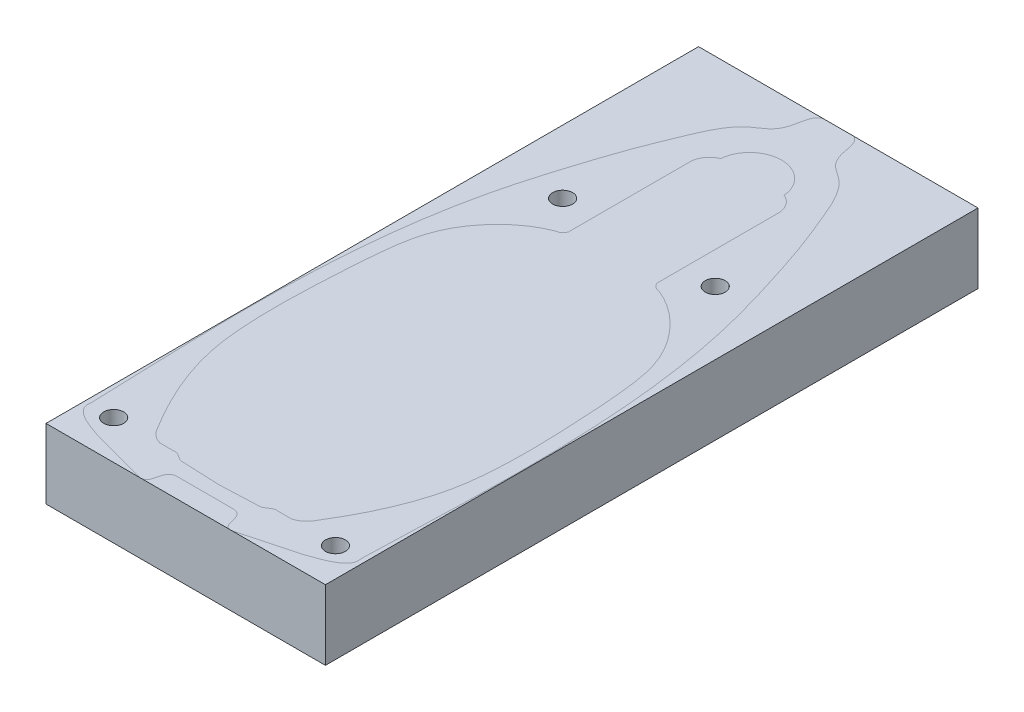
ISO-10303-21;
HEADER;
FILE_DESCRIPTION(('STEP AP214'),'2;1');
FILE_NAME('part.step','',(''),(''),'','','');
FILE_SCHEMA(('AUTOMOTIVE_DESIGN { 1 0 10303 214 1 1 1 1 }'));
ENDSEC;
DATA;
#1=APPLICATION_CONTEXT('core data for automotive mechanical design processes');
#2=APPLICATION_PROTOCOL_DEFINITION('international standard','automotive_design',2000,#1);
#3=PRODUCT_CONTEXT('',#1,'mechanical');
#4=PRODUCT('Part','Part','',(#3));
#5=PRODUCT_RELATED_PRODUCT_CATEGORY('part','',(#4));
#6=PRODUCT_DEFINITION_FORMATION('','',#4);
#7=PRODUCT_DEFINITION_CONTEXT('part definition',#1,'design');
#8=PRODUCT_DEFINITION('design','',#6,#7);
#9=PRODUCT_DEFINITION_SHAPE('','',#8);
#10=(LENGTH_UNIT() NAMED_UNIT(*) SI_UNIT(.MILLI.,.METRE.));
#11=(NAMED_UNIT(*) PLANE_ANGLE_UNIT() SI_UNIT($,.RADIAN.));
#12=(NAMED_UNIT(*) SI_UNIT($,.STERADIAN.) SOLID_ANGLE_UNIT());
#13=UNCERTAINTY_MEASURE_WITH_UNIT(LENGTH_MEASURE(1.E-05),#10,'distance_accuracy_value','');
#14=(GEOMETRIC_REPRESENTATION_CONTEXT(3) GLOBAL_UNCERTAINTY_ASSIGNED_CONTEXT((#13)) GLOBAL_UNIT_ASSIGNED_CONTEXT((#10,
#11,#12)) REPRESENTATION_CONTEXT('',''));
#15=CARTESIAN_POINT('',(0.,0.,0.));
#16=DIRECTION('',(0.,0.,1.));
#17=DIRECTION('',(1.,0.,0.));
#18=AXIS2_PLACEMENT_3D('',#15,#16,#17);
#19=CARTESIAN_POINT('',(0.,0.,0.));
#20=DIRECTION('',(0.,1.,0.));
#21=DIRECTION('',(0.,0.,1.));
#22=AXIS2_PLACEMENT_3D('',#19,#20,#21);
#23=PLANE('',#22);
#24=CARTESIAN_POINT('',(49.0771390945343,0.,5.29231725308454));
#25=CARTESIAN_POINT('',(50.0643876971976,0.,-26.1166546003382));
#26=CARTESIAN_POINT('',(52.5308597652175,0.,-73.6432190761408));
#27=CARTESIAN_POINT('',(44.7383078884643,0.,-128.665983430975));
#28=CARTESIAN_POINT('',(35.9601332946944,0.,-157.773461945844));
#29=CARTESIAN_POINT('',(30.5496339932385,0.,-174.097860196995));
#30=CARTESIAN_POINT('',(25.1053448282694,0.,-187.023597166548));
#31=CARTESIAN_POINT('',(21.9225096731139,0.,-195.198487494332));
#32=CARTESIAN_POINT('',(17.1350520974341,0.,-200.878659028551));
#33=CARTESIAN_POINT('',(13.9883491589994,0.,-202.878315551012));
#34=CARTESIAN_POINT('',(10.4503111705911,0.,-205.542036854755));
#35=CARTESIAN_POINT('',(8.81846815225018,0.,-209.809743179157));
#36=CARTESIAN_POINT('',(8.28664446761546,0.,-214.603179479271));
#37=CARTESIAN_POINT('',(6.56648538168442,0.,-217.643267046185));
#38=CARTESIAN_POINT('',(4.44551305669855,0.,-217.442534032527));
#39=B_SPLINE_CURVE_WITH_KNOTS('',3,(#24,#25,#26,#27,#28,#29,#30,#31,#32,#33,#34,#35,#36,#37,
#38),.UNSPECIFIED.,.F.,.F.,(4,1,1,1,1,1,1,1,1,1,1,1,4),(0.,0.403543259874789,0.608256673125079,
0.708690029533401,0.793482633199347,0.828511750834164,0.889032788817372,0.904436963315368,
0.922735578708441,0.936741401648004,0.960440646033117,0.977903149186417,1.),.UNSPECIFIED.);
#40=CARTESIAN_POINT('',(5.10291944520036,0.,-217.442534032527));
#41=VERTEX_POINT('',#40);
#42=CARTESIAN_POINT('',(49.0771390945343,0.,5.29231725308449));
#43=VERTEX_POINT('',#42);
#44=EDGE_CURVE('E397',#41,#43,#39,.F.);
#45=ORIENTED_EDGE('',*,*,#44,.F.);
#46=DIRECTION('',(1.,0.,0.));
#47=VECTOR('',#46,1.);
#48=CARTESIAN_POINT('',(0.,0.,-217.442534032527));
#49=LINE('',#48,#47);
#50=CARTESIAN_POINT('',(4.44551305669855,0.,-217.442534032527));
#51=VERTEX_POINT('',#50);
#52=EDGE_CURVE('E292',#51,#41,#49,.T.);
#53=ORIENTED_EDGE('',*,*,#52,.F.);
#54=DIRECTION('',(1.,0.,0.));
#55=VECTOR('',#54,1.);
#56=CARTESIAN_POINT('',(0.,0.,-217.442534032527));
#57=LINE('',#56,#55);
#58=CARTESIAN_POINT('',(-5.10291944519914,0.,-217.442534032527));
#59=VERTEX_POINT('',#58);
#60=EDGE_CURVE('E297',#59,#51,#57,.T.);
#61=ORIENTED_EDGE('',*,*,#60,.F.);
#62=CARTESIAN_POINT('',(-4.44551305669855,0.,-217.442534032527));
#63=CARTESIAN_POINT('',(-6.56648538168442,0.,-217.643267046185));
#64=CARTESIAN_POINT('',(-8.28664446761557,0.,-214.603179479271));
#65=CARTESIAN_POINT('',(-8.81846815225012,0.,-209.809743179157));
#66=CARTESIAN_POINT('',(-10.4503111705909,0.,-205.542036854756));
#67=CARTESIAN_POINT('',(-13.9883491589995,0.,-202.878315551012));
#68=CARTESIAN_POINT('',(-17.135052097434,0.,-200.878659028551));
#69=CARTESIAN_POINT('',(-21.922509673114,0.,-195.198487494332));
#70=CARTESIAN_POINT('',(-25.1053448282694,0.,-187.023597166548));
#71=CARTESIAN_POINT('',(-30.5496339932385,0.,-174.097860196995));
#72=CARTESIAN_POINT('',(-35.9601332946944,0.,-157.773461945844));
#73=CARTESIAN_POINT('',(-44.7383078884644,0.,-128.665983430975));
#74=CARTESIAN_POINT('',(-52.5308597652175,0.,-73.6432190761409));
#75=CARTESIAN_POINT('',(-50.0643876971976,0.,-26.1166546003381));
#76=CARTESIAN_POINT('',(-49.0771390945343,0.,5.29231725308466));
#77=B_SPLINE_CURVE_WITH_KNOTS('',3,(#62,#63,#64,#65,#66,#67,#68,#69,#70,#71,#72,#73,#74,#75,
#76),.UNSPECIFIED.,.F.,.F.,(4,1,1,1,1,1,1,1,1,1,1,1,4),(0.,0.0220968508135826,
0.0395593539668829,0.0632585983519958,0.0772644212915593,0.0955630366846325,0.110967211182628,
0.171488249165836,0.206517366800653,0.291309970466599,0.391743326874921,0.596456740125211,1.),.UNSPECIFIED.);
#78=CARTESIAN_POINT('',(-49.0771390945343,0.,5.2923172530846));
#79=VERTEX_POINT('',#78);
#80=EDGE_CURVE('E381',#79,#59,#77,.F.);
#81=ORIENTED_EDGE('',*,*,#80,.F.);
#82=CARTESIAN_POINT('',(-49.0771390945343,0.,5.2923172530846));
#83=CARTESIAN_POINT('',(-50.5688883170867,0.,10.9400693856976));
#84=CARTESIAN_POINT('',(-38.8328719776198,0.,13.504300857401));
#85=CARTESIAN_POINT('',(-37.419094930345,0.,14.3418901157242));
#86=B_SPLINE_CURVE_WITH_KNOTS('',3,(#82,#83,#84,#85),.UNSPECIFIED.,.F.,.F.,(4,4),(0.,1.),.UNSPECIFIED.);
#87=CARTESIAN_POINT('',(-37.419094930345,0.,14.3418901157242));
#88=VERTEX_POINT('',#87);
#89=EDGE_CURVE('E375',#88,#79,#86,.F.);
#90=ORIENTED_EDGE('',*,*,#89,.F.);
#91=DIRECTION('',(-0.966268306599688,0.,-0.257537491757941));
#92=VECTOR('',#91,1.);
#93=CARTESIAN_POINT('',(-6.05082630126968,0.,22.702409826807));
#94=LINE('',#93,#92);
#95=CARTESIAN_POINT('',(-18.3852400543082,0.,19.4149440592082));
#96=VERTEX_POINT('',#95);
#97=EDGE_CURVE('E371',#96,#88,#94,.T.);
#98=ORIENTED_EDGE('',*,*,#97,.F.);
#99=CARTESIAN_POINT('',(-18.3852400543082,0.,19.4149440592082));
#100=CARTESIAN_POINT('',(-11.6134098720276,0.,21.8048769182164));
#101=CARTESIAN_POINT('',(-15.7198055855271,0.,13.4117589348677));
#102=CARTESIAN_POINT('',(-10.5714203288874,0.,12.7273836483514));
#103=B_SPLINE_CURVE_WITH_KNOTS('',3,(#99,#100,#101,#102),.UNSPECIFIED.,.F.,.F.,(4,4),(0.,1.),.UNSPECIFIED.);
#104=CARTESIAN_POINT('',(-16.3294710793143,0.,19.8418554112533));
#105=VERTEX_POINT('',#104);
#106=EDGE_CURVE('E365',#105,#96,#103,.F.);
#107=ORIENTED_EDGE('',*,*,#106,.F.);
#108=CARTESIAN_POINT('',(-10.5714203288874,0.,12.7273836483514));
#109=VERTEX_POINT('',#108);
#110=EDGE_CURVE('E358',#109,#105,#103,.F.);
#111=ORIENTED_EDGE('',*,*,#110,.F.);
#112=DIRECTION('',(-1.,0.,0.));
#113=VECTOR('',#112,1.);
#114=CARTESIAN_POINT('',(0.,0.,12.7273836483513));
#115=LINE('',#114,#113);
#116=CARTESIAN_POINT('',(10.5714203288874,0.,12.7273836483514));
#117=VERTEX_POINT('',#116);
#118=EDGE_CURVE('E351',#117,#109,#115,.T.);
#119=ORIENTED_EDGE('',*,*,#118,.F.);
#120=CARTESIAN_POINT('',(10.5714203288874,0.,12.7273836483514));
#121=CARTESIAN_POINT('',(15.7198055855273,0.,13.4117589348679));
#122=CARTESIAN_POINT('',(11.6134098720275,0.,21.804876918216));
#123=CARTESIAN_POINT('',(18.3852400543081,0.,19.4149440592081));
#124=B_SPLINE_CURVE_WITH_KNOTS('',3,(#120,#121,#122,#123),.UNSPECIFIED.,.F.,.F.,(4,4),(0.,1.),.UNSPECIFIED.);
#125=CARTESIAN_POINT('',(16.3294710793472,0.,19.8418554112533));
#126=VERTEX_POINT('',#125);
#127=EDGE_CURVE('E344',#126,#117,#124,.F.);
#128=ORIENTED_EDGE('',*,*,#127,.F.);
#129=CARTESIAN_POINT('',(18.3852400543081,0.,19.4149440592081));
#130=VERTEX_POINT('',#129);
#131=EDGE_CURVE('E350',#130,#126,#124,.F.);
#132=ORIENTED_EDGE('',*,*,#131,.F.);
#133=DIRECTION('',(-0.966268306599688,0.,0.25753749175794));
#134=VECTOR('',#133,1.);
#135=CARTESIAN_POINT('',(6.05082630126964,0.,22.7024098268069));
#136=LINE('',#135,#134);
#137=CARTESIAN_POINT('',(37.419094930345,0.,14.3418901157241));
#138=VERTEX_POINT('',#137);
#139=EDGE_CURVE('E364',#138,#130,#136,.T.);
#140=ORIENTED_EDGE('',*,*,#139,.F.);
#141=CARTESIAN_POINT('',(37.419094930345,0.,14.3418901157241));
#142=CARTESIAN_POINT('',(38.832871977619,0.,13.5043008574007));
#143=CARTESIAN_POINT('',(50.5688883170869,0.,10.9400693856976));
#144=CARTESIAN_POINT('',(49.0771390945343,0.,5.29231725308449));
#145=B_SPLINE_CURVE_WITH_KNOTS('',3,(#141,#142,#143,#144),.UNSPECIFIED.,.F.,.F.,(4,4),(0.,1.),.UNSPECIFIED.);
#146=EDGE_CURVE('E389',#43,#138,#145,.F.);
#147=ORIENTED_EDGE('',*,*,#146,.F.);
#148=EDGE_LOOP('',(#45,#53,#61,#81,#90,#98,#107,#111,#119,#128,#132,#140,#147));
#149=FACE_BOUND('',#148,.T.);
#150=CARTESIAN_POINT('',(40.3206229095368,0.,5.71600751054374));
#151=DIRECTION('',(0.,1.,0.));
#152=DIRECTION('',(0.,0.,1.));
#153=AXIS2_PLACEMENT_3D('',#150,#151,#152);
#154=CIRCLE('',#153,3.6247382617778);
#155=CARTESIAN_POINT('',(40.3206229095368,0.,9.34074577232154));
#156=VERTEX_POINT('',#155);
#157=EDGE_CURVE('E318',#156,#156,#154,.F.);
#158=ORIENTED_EDGE('',*,*,#157,.T.);
#159=EDGE_LOOP('',(#158));
#160=FACE_BOUND('',#159,.T.);
#161=CARTESIAN_POINT('',(-40.3206229095368,0.,5.71600751054385));
#162=DIRECTION('',(0.,1.,0.));
#163=DIRECTION('',(0.,0.,1.));
#164=AXIS2_PLACEMENT_3D('',#161,#162,#163);
#165=CIRCLE('',#164,3.62473826177782);
#166=CARTESIAN_POINT('',(-40.3206229095368,0.,9.34074577232168));
#167=VERTEX_POINT('',#166);
#168=EDGE_CURVE('E322',#167,#167,#165,.T.);
#169=ORIENTED_EDGE('',*,*,#168,.F.);
#170=EDGE_LOOP('',(#169));
#171=FACE_BOUND('',#170,.T.);
#172=CARTESIAN_POINT('',(-27.7449906587386,0.,-144.952451062197));
#173=DIRECTION('',(0.,1.,0.));
#174=DIRECTION('',(0.,0.,1.));
#175=AXIS2_PLACEMENT_3D('',#172,#173,#174);
#176=CIRCLE('',#175,3.62473826177782);
#177=CARTESIAN_POINT('',(-27.7449906587386,0.,-141.327712800419));
#178=VERTEX_POINT('',#177);
#179=EDGE_CURVE('E212',#178,#178,#176,.T.);
#180=ORIENTED_EDGE('',*,*,#179,.F.);
#181=EDGE_LOOP('',(#180));
#182=FACE_BOUND('',#181,.T.);
#183=CARTESIAN_POINT('',(27.7449906587385,0.,-144.952451062197));
#184=DIRECTION('',(0.,1.,0.));
#185=DIRECTION('',(0.,0.,1.));
#186=AXIS2_PLACEMENT_3D('',#183,#184,#185);
#187=CIRCLE('',#186,3.6247382617778);
#188=CARTESIAN_POINT('',(27.7449906587385,0.,-141.327712800419));
#189=VERTEX_POINT('',#188);
#190=EDGE_CURVE('E208',#189,#189,#187,.F.);
#191=ORIENTED_EDGE('',*,*,#190,.T.);
#192=EDGE_LOOP('',(#191));
#193=FACE_BOUND('',#192,.T.);
#194=DIRECTION('',(0.,0.,-1.));
#195=VECTOR('',#194,1.);
#196=CARTESIAN_POINT('',(-16.1045382347162,0.,0.));
#197=LINE('',#196,#195);
#198=CARTESIAN_POINT('',(-16.1045382347163,0.,-135.534945765243));
#199=VERTEX_POINT('',#198);
#200=CARTESIAN_POINT('',(-16.1045382347162,0.,-179.48987237625));
#201=VERTEX_POINT('',#200);
#202=EDGE_CURVE('E54',#199,#201,#197,.T.);
#203=ORIENTED_EDGE('',*,*,#202,.T.);
#204=CARTESIAN_POINT('',(-8.92288832461977,0.,-179.48987237625));
#205=DIRECTION('',(0.,1.,0.));
#206=DIRECTION('',(0.,0.,1.));
#207=AXIS2_PLACEMENT_3D('',#204,#205,#206);
#208=CIRCLE('',#207,7.18164991009649);
#209=CARTESIAN_POINT('',(-11.5472751039841,0.,-186.174832321043));
#210=VERTEX_POINT('',#209);
#211=EDGE_CURVE('E11',#201,#210,#208,.F.);
#212=ORIENTED_EDGE('',*,*,#211,.T.);
#213=CARTESIAN_POINT('',(0.,0.,-185.222255850204));
#214=DIRECTION('',(0.,1.,0.));
#215=DIRECTION('',(0.,0.,1.));
#216=AXIS2_PLACEMENT_3D('',#213,#214,#215);
#217=CIRCLE('',#216,11.5864992236605);
#218=CARTESIAN_POINT('',(11.5472751039841,0.,-186.174832321043));
#219=VERTEX_POINT('',#218);
#220=EDGE_CURVE('E405',#210,#219,#217,.F.);
#221=ORIENTED_EDGE('',*,*,#220,.T.);
#222=CARTESIAN_POINT('',(8.92288832461979,0.,-179.48987237625));
#223=DIRECTION('',(0.,1.,0.));
#224=DIRECTION('',(0.,0.,1.));
#225=AXIS2_PLACEMENT_3D('',#222,#223,#224);
#226=CIRCLE('',#225,7.18164991009647);
#227=CARTESIAN_POINT('',(16.1045382347163,0.,-179.48987237625));
#228=VERTEX_POINT('',#227);
#229=EDGE_CURVE('E412',#219,#228,#226,.F.);
#230=ORIENTED_EDGE('',*,*,#229,.T.);
#231=DIRECTION('',(0.,0.,1.));
#232=VECTOR('',#231,1.);
#233=CARTESIAN_POINT('',(16.1045382347162,0.,0.));
#234=LINE('',#233,#232);
#235=CARTESIAN_POINT('',(16.1045382347162,0.,-135.534945765243));
#236=VERTEX_POINT('',#235);
#237=EDGE_CURVE('E416',#228,#236,#234,.T.);
#238=ORIENTED_EDGE('',*,*,#237,.T.);
#239=CARTESIAN_POINT('',(19.0012718307022,0.,-136.351122874709));
#240=DIRECTION('',(0.,1.,0.));
#241=DIRECTION('',(0.,0.,1.));
#242=AXIS2_PLACEMENT_3D('',#239,#240,#241);
#243=CIRCLE('',#242,3.00951999497092);
#244=CARTESIAN_POINT('',(18.7446615171418,0.,-133.352562929151));
#245=VERTEX_POINT('',#244);
#246=EDGE_CURVE('E420',#236,#245,#243,.T.);
#247=ORIENTED_EDGE('',*,*,#246,.T.);
#248=CARTESIAN_POINT('',(28.9897543021521,0.,1.11262704182102));
#249=CARTESIAN_POINT('',(35.9471156603791,0.,-10.0985478623123));
#250=CARTESIAN_POINT('',(43.216376698589,0.,-25.6573281184342));
#251=CARTESIAN_POINT('',(45.6029115810602,0.,-47.6860224426251));
#252=CARTESIAN_POINT('',(45.8816375135089,0.,-62.8086245314313));
#253=CARTESIAN_POINT('',(45.0500773289797,0.,-79.5297272696832));
#254=CARTESIAN_POINT('',(43.965647760869,0.,-96.1245135547548));
#255=CARTESIAN_POINT('',(41.637553201633,0.,-111.373856913353));
#256=CARTESIAN_POINT('',(32.6029748866559,0.,-124.998790744143));
#257=CARTESIAN_POINT('',(24.0724426524856,0.,-131.292430099998));
#258=CARTESIAN_POINT('',(18.7446615171418,0.,-133.352562929151));
#259=B_SPLINE_CURVE_WITH_KNOTS('',3,(#248,#249,#250,#251,#252,#253,#254,#255,#256,#257,#258),
.UNSPECIFIED.,.F.,.F.,(4,1,1,1,1,1,1,1,4),(0.,0.270443115932794,0.337210977163026,
0.449064606803327,0.577405053328751,0.676752021145974,0.788024920003265,0.885248270529085,1.),.UNSPECIFIED.);
#260=CARTESIAN_POINT('',(28.9897543021521,0.,1.11262704182102));
#261=VERTEX_POINT('',#260);
#262=EDGE_CURVE('E424',#245,#261,#259,.F.);
#263=ORIENTED_EDGE('',*,*,#262,.T.);
#264=CARTESIAN_POINT('',(23.9297097430107,0.,5.29231725308449));
#265=CARTESIAN_POINT('',(26.1031516888282,0.,4.73079484247713));
#266=CARTESIAN_POINT('',(27.9741559493832,0.,3.09986950265528));
#267=CARTESIAN_POINT('',(28.9897543021521,0.,1.11262704182102));
#268=B_SPLINE_CURVE_WITH_KNOTS('',3,(#264,#265,#266,#267),.UNSPECIFIED.,.F.,.F.,(4,4),(0.,1.),.UNSPECIFIED.);
#269=CARTESIAN_POINT('',(23.9297097430107,0.,5.29231725308449));
#270=VERTEX_POINT('',#269);
#271=EDGE_CURVE('E430',#261,#270,#268,.F.);
#272=ORIENTED_EDGE('',*,*,#271,.T.);
#273=DIRECTION('',(-1.,0.,0.));
#274=VECTOR('',#273,1.);
#275=CARTESIAN_POINT('',(0.,0.,5.29231725308449));
#276=LINE('',#275,#274);
#277=CARTESIAN_POINT('',(19.0012718307022,0.,5.29231725308449));
#278=VERTEX_POINT('',#277);
#279=EDGE_CURVE('E439',#270,#278,#276,.T.);
#280=ORIENTED_EDGE('',*,*,#279,.T.);
#281=CARTESIAN_POINT('',(14.3058881807214,0.,7.10813264219567));
#282=CARTESIAN_POINT('',(16.0767091536674,0.,6.85623125618423));
#283=CARTESIAN_POINT('',(16.9934407863588,0.,4.84756479524606));
#284=CARTESIAN_POINT('',(19.0012718307022,0.,5.29231725308449));
#285=B_SPLINE_CURVE_WITH_KNOTS('',3,(#281,#282,#283,#284),.UNSPECIFIED.,.F.,.F.,(4,4),(0.,1.),.UNSPECIFIED.);
#286=CARTESIAN_POINT('',(14.3058881807214,0.,7.10813264219567));
#287=VERTEX_POINT('',#286);
#288=EDGE_CURVE('E446',#278,#287,#285,.F.);
#289=ORIENTED_EDGE('',*,*,#288,.T.);
#290=DIRECTION('',(-0.999106162356931,0.,0.0422714601167913));
#291=VECTOR('',#290,1.);
#292=CARTESIAN_POINT('',(0.32576542618756,0.,7.69962153868293));
#293=LINE('',#292,#291);
#294=CARTESIAN_POINT('',(0.,0.,7.71340443857821));
#295=VERTEX_POINT('',#294);
#296=EDGE_CURVE('E452',#287,#295,#293,.T.);
#297=ORIENTED_EDGE('',*,*,#296,.T.);
#298=DIRECTION('',(-0.999106162356932,0.,-0.0422714601167836));
#299=VECTOR('',#298,1.);
#300=CARTESIAN_POINT('',(-0.3257654261875,0.,7.69962153868294));
#301=LINE('',#300,#299);
#302=CARTESIAN_POINT('',(-14.3058881807214,0.,7.10813264219579));
#303=VERTEX_POINT('',#302);
#304=EDGE_CURVE('E459',#295,#303,#301,.T.);
#305=ORIENTED_EDGE('',*,*,#304,.T.);
#306=CARTESIAN_POINT('',(-19.0012718307022,0.,5.2923172530846));
#307=CARTESIAN_POINT('',(-16.9934407863586,0.,4.84756479524601));
#308=CARTESIAN_POINT('',(-16.0767091536676,0.,6.85623125618451));
#309=CARTESIAN_POINT('',(-14.3058881807214,0.,7.10813264219579));
#310=B_SPLINE_CURVE_WITH_KNOTS('',3,(#306,#307,#308,#309),.UNSPECIFIED.,.F.,.F.,(4,4),(0.,1.),.UNSPECIFIED.);
#311=CARTESIAN_POINT('',(-19.0012718307022,0.,5.2923172530846));
#312=VERTEX_POINT('',#311);
#313=EDGE_CURVE('E463',#303,#312,#310,.F.);
#314=ORIENTED_EDGE('',*,*,#313,.T.);
#315=DIRECTION('',(-1.,0.,0.));
#316=VECTOR('',#315,1.);
#317=CARTESIAN_POINT('',(0.,0.,5.2923172530846));
#318=LINE('',#317,#316);
#319=CARTESIAN_POINT('',(-23.9297097430108,0.,5.2923172530846));
#320=VERTEX_POINT('',#319);
#321=EDGE_CURVE('E469',#312,#320,#318,.T.);
#322=ORIENTED_EDGE('',*,*,#321,.T.);
#323=CARTESIAN_POINT('',(-28.9897543021521,0.,1.11262704182113));
#324=CARTESIAN_POINT('',(-27.9741559493833,0.,3.09986950265539));
#325=CARTESIAN_POINT('',(-26.1031516888281,0.,4.73079484247724));
#326=CARTESIAN_POINT('',(-23.9297097430108,0.,5.2923172530846));
#327=B_SPLINE_CURVE_WITH_KNOTS('',3,(#323,#324,#325,#326),.UNSPECIFIED.,.F.,.F.,(4,4),(0.,1.),.UNSPECIFIED.);
#328=CARTESIAN_POINT('',(-28.9897543021521,0.,1.11262704182113));
#329=VERTEX_POINT('',#328);
#330=EDGE_CURVE('E476',#320,#329,#327,.F.);
#331=ORIENTED_EDGE('',*,*,#330,.T.);
#332=CARTESIAN_POINT('',(-18.7446615171418,0.,-133.352562929151));
#333=CARTESIAN_POINT('',(-24.0724426524855,0.,-131.292430099998));
#334=CARTESIAN_POINT('',(-32.602974886656,0.,-124.998790744143));
#335=CARTESIAN_POINT('',(-41.637553201633,0.,-111.373856913353));
#336=CARTESIAN_POINT('',(-43.965647760869,0.,-96.1245135547549));
#337=CARTESIAN_POINT('',(-45.0500773289798,0.,-79.5297272696831));
#338=CARTESIAN_POINT('',(-45.8816375135087,0.,-62.8086245314311));
#339=CARTESIAN_POINT('',(-45.6029115810603,0.,-47.686022442625));
#340=CARTESIAN_POINT('',(-43.2163766985889,0.,-25.657328118434));
#341=CARTESIAN_POINT('',(-35.9471156603794,0.,-10.0985478623124));
#342=CARTESIAN_POINT('',(-28.9897543021521,0.,1.11262704182108));
#343=B_SPLINE_CURVE_WITH_KNOTS('',3,(#332,#333,#334,#335,#336,#337,#338,#339,#340,#341,#342),
.UNSPECIFIED.,.F.,.F.,(4,1,1,1,1,1,1,1,4),(0.,0.114751729470915,0.211975079996735,
0.323247978854026,0.422594946671248,0.550935393196673,0.662789022836974,0.729556884067206,1.),.UNSPECIFIED.);
#344=CARTESIAN_POINT('',(-18.7446615171418,0.,-133.352562929151));
#345=VERTEX_POINT('',#344);
#346=EDGE_CURVE('E482',#329,#345,#343,.F.);
#347=ORIENTED_EDGE('',*,*,#346,.T.);
#348=CARTESIAN_POINT('',(-19.0012718307022,0.,-136.351122874709));
#349=DIRECTION('',(0.,1.,0.));
#350=DIRECTION('',(0.,0.,1.));
#351=AXIS2_PLACEMENT_3D('',#348,#349,#350);
#352=CIRCLE('',#351,3.00951999497094);
#353=EDGE_CURVE('E491',#345,#199,#352,.T.);
#354=ORIENTED_EDGE('',*,*,#353,.T.);
#355=EDGE_LOOP('',(#203,#212,#221,#230,#238,#247,#263,#272,#280,#289,#297,#305,#314,#322,#331,
#347,#354));
#356=FACE_BOUND('',#355,.T.);
#357=ADVANCED_FACE('F45',(#149,#160,#171,#182,#193,#356),#23,.T.);
#358=DIRECTION('',(1.,0.,0.));
#359=VECTOR('',#358,1.);
#360=CARTESIAN_POINT('',(0.,0.,-217.442534032527));
#361=LINE('',#360,#359);
#362=CARTESIAN_POINT('',(50.8,0.,-217.442534032527));
#363=VERTEX_POINT('',#362);
#364=EDGE_CURVE('E298',#41,#363,#361,.T.);
#365=ORIENTED_EDGE('',*,*,#364,.F.);
#366=ORIENTED_EDGE('',*,*,#44,.T.);
#367=ORIENTED_EDGE('',*,*,#146,.T.);
#368=ORIENTED_EDGE('',*,*,#139,.T.);
#369=ORIENTED_EDGE('',*,*,#131,.T.);
#370=DIRECTION('',(1.,0.,0.));
#371=VECTOR('',#370,1.);
#372=CARTESIAN_POINT('',(0.,0.,19.8418554112533));
#373=LINE('',#372,#371);
#374=CARTESIAN_POINT('',(50.8,0.,19.8418554112533));
#375=VERTEX_POINT('',#374);
#376=EDGE_CURVE('E610',#126,#375,#373,.T.);
#377=ORIENTED_EDGE('',*,*,#376,.T.);
#378=DIRECTION('',(0.,0.,1.));
#379=VECTOR('',#378,1.);
#380=CARTESIAN_POINT('',(50.8,0.,0.));
#381=LINE('',#380,#379);
#382=EDGE_CURVE('E198',#363,#375,#381,.T.);
#383=ORIENTED_EDGE('',*,*,#382,.F.);
#384=EDGE_LOOP('',(#365,#366,#367,#368,#369,#377,#383));
#385=FACE_BOUND('',#384,.T.);
#386=ADVANCED_FACE('F256',(#385),#23,.T.);
#387=ORIENTED_EDGE('',*,*,#89,.T.);
#388=ORIENTED_EDGE('',*,*,#80,.T.);
#389=CARTESIAN_POINT('',(-50.8,0.,-217.442534032527));
#390=VERTEX_POINT('',#389);
#391=EDGE_CURVE('E302',#390,#59,#57,.T.);
#392=ORIENTED_EDGE('',*,*,#391,.F.);
#393=DIRECTION('',(0.,0.,1.));
#394=VECTOR('',#393,1.);
#395=CARTESIAN_POINT('',(-50.8,0.,0.));
#396=LINE('',#395,#394);
#397=CARTESIAN_POINT('',(-50.8,0.,19.8418554112533));
#398=VERTEX_POINT('',#397);
#399=EDGE_CURVE('E314',#390,#398,#396,.T.);
#400=ORIENTED_EDGE('',*,*,#399,.T.);
#401=EDGE_CURVE('E612',#398,#105,#373,.T.);
#402=ORIENTED_EDGE('',*,*,#401,.T.);
#403=ORIENTED_EDGE('',*,*,#106,.T.);
#404=ORIENTED_EDGE('',*,*,#97,.T.);
#405=EDGE_LOOP('',(#387,#388,#392,#400,#402,#403,#404));
#406=FACE_BOUND('',#405,.T.);
#407=ADVANCED_FACE('F263',(#406),#23,.T.);
#408=ORIENTED_EDGE('',*,*,#118,.T.);
#409=ORIENTED_EDGE('',*,*,#110,.T.);
#410=EDGE_CURVE('E615',#105,#126,#373,.T.);
#411=ORIENTED_EDGE('',*,*,#410,.T.);
#412=ORIENTED_EDGE('',*,*,#127,.T.);
#413=EDGE_LOOP('',(#408,#409,#411,#412));
#414=FACE_BOUND('',#413,.T.);
#415=ADVANCED_FACE('F279',(#414),#23,.T.);
#416=CARTESIAN_POINT('',(4.44551305669855,0.,-217.442534032527));
#417=CARTESIAN_POINT('',(6.56648538168442,0.,-217.643267046185));
#418=CARTESIAN_POINT('',(8.28664446761546,0.,-214.603179479271));
#419=CARTESIAN_POINT('',(8.81846815225018,0.,-209.809743179157));
#420=CARTESIAN_POINT('',(10.4503111705911,0.,-205.542036854755));
#421=CARTESIAN_POINT('',(13.9883491589994,0.,-202.878315551012));
#422=CARTESIAN_POINT('',(17.1350520974341,0.,-200.878659028551));
#423=CARTESIAN_POINT('',(21.9225096731139,0.,-195.198487494332));
#424=CARTESIAN_POINT('',(25.1053448282694,0.,-187.023597166548));
#425=CARTESIAN_POINT('',(30.5496339932385,0.,-174.097860196995));
#426=CARTESIAN_POINT('',(35.9601332946944,0.,-157.773461945844));
#427=CARTESIAN_POINT('',(44.7383078884643,0.,-128.665983430975));
#428=CARTESIAN_POINT('',(52.5308597652175,0.,-73.6432190761408));
#429=CARTESIAN_POINT('',(50.0643876971976,0.,-26.1166546003382));
#430=CARTESIAN_POINT('',(49.0771390945343,0.,5.29231725308454));
#431=B_SPLINE_CURVE_WITH_KNOTS('',3,(#416,#417,#418,#419,#420,#421,#422,#423,#424,#425,#426,
#427,#428,#429,#430),.UNSPECIFIED.,.F.,.F.,(4,1,1,1,1,1,1,1,1,1,1,1,4),(0.,0.0220968508135825,
0.0395593539668829,0.0632585983519959,0.0772644212915592,0.0955630366846324,0.110967211182628,
0.171488249165836,0.206517366800653,0.291309970466599,0.391743326874921,0.596456740125211,1.),.UNSPECIFIED.);
#432=EDGE_CURVE('E290',#51,#41,#431,.T.);
#433=ORIENTED_EDGE('',*,*,#432,.F.);
#434=ORIENTED_EDGE('',*,*,#52,.T.);
#435=EDGE_LOOP('',(#433,#434));
#436=FACE_BOUND('',#435,.T.);
#437=ADVANCED_FACE('F269',(#436),#23,.T.);
#438=CARTESIAN_POINT('',(0.,-25.4,19.8418554112533));
#439=DIRECTION('',(0.,0.,1.));
#440=DIRECTION('',(1.,0.,0.));
#441=AXIS2_PLACEMENT_3D('',#438,#439,#440);
#442=PLANE('',#441);
#443=ORIENTED_EDGE('',*,*,#401,.F.);
#444=DIRECTION('',(0.,1.,0.));
#445=VECTOR('',#444,1.);
#446=CARTESIAN_POINT('',(-50.8,-25.4,19.8418554112533));
#447=LINE('',#446,#445);
#448=CARTESIAN_POINT('',(-50.8,-25.4,19.8418554112533));
#449=VERTEX_POINT('',#448);
#450=EDGE_CURVE('E206',#449,#398,#447,.T.);
#451=ORIENTED_EDGE('',*,*,#450,.F.);
#452=DIRECTION('',(1.,0.,0.));
#453=VECTOR('',#452,1.);
#454=CARTESIAN_POINT('',(0.,-25.4,19.8418554112533));
#455=LINE('',#454,#453);
#456=CARTESIAN_POINT('',(50.8,-25.4,19.8418554112533));
#457=VERTEX_POINT('',#456);
#458=EDGE_CURVE('E184',#449,#457,#455,.T.);
#459=ORIENTED_EDGE('',*,*,#458,.T.);
#460=DIRECTION('',(0.,1.,0.));
#461=VECTOR('',#460,1.);
#462=CARTESIAN_POINT('',(50.8,-25.4,19.8418554112533));
#463=LINE('',#462,#461);
#464=EDGE_CURVE('E195',#457,#375,#463,.T.);
#465=ORIENTED_EDGE('',*,*,#464,.T.);
#466=ORIENTED_EDGE('',*,*,#376,.F.);
#467=ORIENTED_EDGE('',*,*,#410,.F.);
#468=EDGE_LOOP('',(#443,#451,#459,#465,#466,#467));
#469=FACE_BOUND('',#468,.T.);
#470=ADVANCED_FACE('F47',(#469),#442,.T.);
#471=CARTESIAN_POINT('',(-50.8,-25.4,0.));
#472=DIRECTION('',(-1.,0.,0.));
#473=DIRECTION('',(0.,0.,1.));
#474=AXIS2_PLACEMENT_3D('',#471,#472,#473);
#475=PLANE('',#474);
#476=ORIENTED_EDGE('',*,*,#399,.F.);
#477=DIRECTION('',(0.,1.,0.));
#478=VECTOR('',#477,1.);
#479=CARTESIAN_POINT('',(-50.8,-25.4,-217.442534032527));
#480=LINE('',#479,#478);
#481=CARTESIAN_POINT('',(-50.8,-25.4,-217.442534032527));
#482=VERTEX_POINT('',#481);
#483=EDGE_CURVE('E331',#482,#390,#480,.T.);
#484=ORIENTED_EDGE('',*,*,#483,.F.);
#485=DIRECTION('',(0.,0.,1.));
#486=VECTOR('',#485,1.);
#487=CARTESIAN_POINT('',(-50.8,-25.4,0.));
#488=LINE('',#487,#486);
#489=EDGE_CURVE('E601',#482,#449,#488,.T.);
#490=ORIENTED_EDGE('',*,*,#489,.T.);
#491=ORIENTED_EDGE('',*,*,#450,.T.);
#492=EDGE_LOOP('',(#476,#484,#490,#491));
#493=FACE_BOUND('',#492,.T.);
#494=ADVANCED_FACE('F285',(#493),#475,.T.);
#495=CARTESIAN_POINT('',(0.,-25.4,-217.442534032527));
#496=DIRECTION('',(0.,0.,1.));
#497=DIRECTION('',(1.,0.,0.));
#498=AXIS2_PLACEMENT_3D('',#495,#496,#497);
#499=PLANE('',#498);
#500=ORIENTED_EDGE('',*,*,#391,.T.);
#501=ORIENTED_EDGE('',*,*,#60,.T.);
#502=DIRECTION('',(0.,1.,0.));
#503=VECTOR('',#502,1.);
#504=CARTESIAN_POINT('',(4.44551305669855,-25.4,-217.442534032527));
#505=LINE('',#504,#503);
#506=CARTESIAN_POINT('',(4.44551305669855,-25.4,-217.442534032527));
#507=VERTEX_POINT('',#506);
#508=EDGE_CURVE('E334',#507,#51,#505,.T.);
#509=ORIENTED_EDGE('',*,*,#508,.F.);
#510=DIRECTION('',(1.,0.,0.));
#511=VECTOR('',#510,1.);
#512=CARTESIAN_POINT('',(0.,-25.4,-217.442534032527));
#513=LINE('',#512,#511);
#514=EDGE_CURVE('E226',#482,#507,#513,.T.);
#515=ORIENTED_EDGE('',*,*,#514,.F.);
#516=ORIENTED_EDGE('',*,*,#483,.T.);
#517=EDGE_LOOP('',(#500,#501,#509,#515,#516));
#518=FACE_BOUND('',#517,.T.);
#519=ADVANCED_FACE('F237',(#518),#499,.F.);
#520=CARTESIAN_POINT('',(4.44551305669855,-25.4,-217.442534032527));
#521=CARTESIAN_POINT('',(6.56648538168442,-25.4,-217.643267046185));
#522=CARTESIAN_POINT('',(8.28664446761546,-25.4,-214.603179479271));
#523=CARTESIAN_POINT('',(8.81846815225018,-25.4,-209.809743179157));
#524=CARTESIAN_POINT('',(10.4503111705911,-25.4,-205.542036854755));
#525=CARTESIAN_POINT('',(13.9883491589994,-25.4,-202.878315551012));
#526=CARTESIAN_POINT('',(17.1350520974341,-25.4,-200.878659028551));
#527=CARTESIAN_POINT('',(21.9225096731139,-25.4,-195.198487494332));
#528=CARTESIAN_POINT('',(25.1053448282694,-25.4,-187.023597166548));
#529=CARTESIAN_POINT('',(30.5496339932385,-25.4,-174.097860196995));
#530=CARTESIAN_POINT('',(35.9601332946944,-25.4,-157.773461945844));
#531=CARTESIAN_POINT('',(44.7383078884643,-25.4,-128.665983430975));
#532=CARTESIAN_POINT('',(52.5308597652175,-25.4,-73.6432190761408));
#533=CARTESIAN_POINT('',(50.0643876971976,-25.4,-26.1166546003382));
#534=CARTESIAN_POINT('',(49.0771390945343,-25.4,5.29231725308454));
#535=B_SPLINE_CURVE_WITH_KNOTS('',3,(#520,#521,#522,#523,#524,#525,#526,#527,#528,#529,#530,
#531,#532,#533,#534),.UNSPECIFIED.,.F.,.F.,(4,1,1,1,1,1,1,1,1,1,1,1,4),(0.,0.0220968508135825,
0.0395593539668829,0.0632585983519959,0.0772644212915592,0.0955630366846324,0.110967211182628,
0.171488249165836,0.206517366800653,0.291309970466599,0.391743326874921,0.596456740125211,1.),.UNSPECIFIED.);
#536=DIRECTION('',(0.,1.,0.));
#537=VECTOR('',#536,1.);
#538=SURFACE_OF_LINEAR_EXTRUSION('',#535,#537);
#539=ORIENTED_EDGE('',*,*,#432,.T.);
#540=DIRECTION('',(0.,1.,0.));
#541=VECTOR('',#540,1.);
#542=CARTESIAN_POINT('',(5.10291944520036,-25.4,-217.442534032527));
#543=LINE('',#542,#541);
#544=CARTESIAN_POINT('',(5.10291944520036,-25.4,-217.442534032527));
#545=VERTEX_POINT('',#544);
#546=EDGE_CURVE('E337',#545,#41,#543,.T.);
#547=ORIENTED_EDGE('',*,*,#546,.F.);
#548=EDGE_CURVE('E220',#507,#545,#535,.T.);
#549=ORIENTED_EDGE('',*,*,#548,.F.);
#550=ORIENTED_EDGE('',*,*,#508,.T.);
#551=EDGE_LOOP('',(#539,#547,#549,#550));
#552=FACE_BOUND('',#551,.T.);
#553=ADVANCED_FACE('F232',(#552),#538,.F.);
#554=CARTESIAN_POINT('',(0.,-25.4,-217.442534032527));
#555=DIRECTION('',(0.,0.,1.));
#556=DIRECTION('',(1.,0.,0.));
#557=AXIS2_PLACEMENT_3D('',#554,#555,#556);
#558=PLANE('',#557);
#559=ORIENTED_EDGE('',*,*,#364,.T.);
#560=DIRECTION('',(0.,1.,0.));
#561=VECTOR('',#560,1.);
#562=CARTESIAN_POINT('',(50.8,-25.4,-217.442534032527));
#563=LINE('',#562,#561);
#564=CARTESIAN_POINT('',(50.8,-25.4,-217.442534032527));
#565=VERTEX_POINT('',#564);
#566=EDGE_CURVE('E202',#565,#363,#563,.T.);
#567=ORIENTED_EDGE('',*,*,#566,.F.);
#568=DIRECTION('',(1.,0.,0.));
#569=VECTOR('',#568,1.);
#570=CARTESIAN_POINT('',(0.,-25.4,-217.442534032527));
#571=LINE('',#570,#569);
#572=EDGE_CURVE('E187',#545,#565,#571,.T.);
#573=ORIENTED_EDGE('',*,*,#572,.F.);
#574=ORIENTED_EDGE('',*,*,#546,.T.);
#575=EDGE_LOOP('',(#559,#567,#573,#574));
#576=FACE_BOUND('',#575,.T.);
#577=ADVANCED_FACE('F236',(#576),#558,.F.);
#578=CARTESIAN_POINT('',(-27.7449906587386,-25.4,-144.952451062197));
#579=DIRECTION('',(0.,1.,0.));
#580=DIRECTION('',(0.,0.,1.));
#581=AXIS2_PLACEMENT_3D('',#578,#579,#580);
#582=CYLINDRICAL_SURFACE('',#581,3.62473826177782);
#583=CARTESIAN_POINT('',(-27.7449906587386,-25.4,-144.952451062197));
#584=DIRECTION('',(0.,1.,0.));
#585=DIRECTION('',(0.,0.,1.));
#586=AXIS2_PLACEMENT_3D('',#583,#584,#585);
#587=CIRCLE('',#586,3.62473826177782);
#588=CARTESIAN_POINT('',(-27.7449906587386,-25.4,-141.327712800419));
#589=VERTEX_POINT('',#588);
#590=EDGE_CURVE('E589',#589,#589,#587,.T.);
#591=ORIENTED_EDGE('',*,*,#590,.F.);
#592=EDGE_LOOP('',(#591));
#593=FACE_BOUND('',#592,.T.);
#594=ORIENTED_EDGE('',*,*,#179,.T.);
#595=EDGE_LOOP('',(#594));
#596=FACE_BOUND('',#595,.T.);
#597=ADVANCED_FACE('F241',(#593,#596),#582,.F.);
#598=CARTESIAN_POINT('',(-40.3206229095368,-25.4,5.71600751054385));
#599=DIRECTION('',(0.,1.,0.));
#600=DIRECTION('',(0.,0.,1.));
#601=AXIS2_PLACEMENT_3D('',#598,#599,#600);
#602=CYLINDRICAL_SURFACE('',#601,3.62473826177782);
#603=CARTESIAN_POINT('',(-40.3206229095368,-25.4,5.71600751054385));
#604=DIRECTION('',(0.,1.,0.));
#605=DIRECTION('',(0.,0.,1.));
#606=AXIS2_PLACEMENT_3D('',#603,#604,#605);
#607=CIRCLE('',#606,3.62473826177782);
#608=CARTESIAN_POINT('',(-40.3206229095368,-25.4,9.34074577232168));
#609=VERTEX_POINT('',#608);
#610=EDGE_CURVE('E593',#609,#609,#607,.T.);
#611=ORIENTED_EDGE('',*,*,#610,.F.);
#612=EDGE_LOOP('',(#611));
#613=FACE_BOUND('',#612,.T.);
#614=ORIENTED_EDGE('',*,*,#168,.T.);
#615=EDGE_LOOP('',(#614));
#616=FACE_BOUND('',#615,.T.);
#617=ADVANCED_FACE('F252',(#613,#616),#602,.F.);
#618=CARTESIAN_POINT('',(40.3206229095368,-25.4,5.71600751054374));
#619=DIRECTION('',(0.,1.,0.));
#620=DIRECTION('',(0.,0.,1.));
#621=AXIS2_PLACEMENT_3D('',#618,#619,#620);
#622=CYLINDRICAL_SURFACE('',#621,3.6247382617778);
#623=CARTESIAN_POINT('',(40.3206229095368,-25.4,5.71600751054374));
#624=DIRECTION('',(0.,1.,0.));
#625=DIRECTION('',(0.,0.,1.));
#626=AXIS2_PLACEMENT_3D('',#623,#624,#625);
#627=CIRCLE('',#626,3.6247382617778);
#628=CARTESIAN_POINT('',(40.3206229095368,-25.4,9.34074577232154));
#629=VERTEX_POINT('',#628);
#630=EDGE_CURVE('E597',#629,#629,#627,.F.);
#631=ORIENTED_EDGE('',*,*,#630,.T.);
#632=EDGE_LOOP('',(#631));
#633=FACE_BOUND('',#632,.T.);
#634=ORIENTED_EDGE('',*,*,#157,.F.);
#635=EDGE_LOOP('',(#634));
#636=FACE_BOUND('',#635,.T.);
#637=ADVANCED_FACE('F245',(#633,#636),#622,.F.);
#638=CARTESIAN_POINT('',(50.8,-25.4,0.));
#639=DIRECTION('',(-1.,0.,0.));
#640=DIRECTION('',(0.,0.,1.));
#641=AXIS2_PLACEMENT_3D('',#638,#639,#640);
#642=PLANE('',#641);
#643=ORIENTED_EDGE('',*,*,#382,.T.);
#644=ORIENTED_EDGE('',*,*,#464,.F.);
#645=DIRECTION('',(0.,0.,1.));
#646=VECTOR('',#645,1.);
#647=CARTESIAN_POINT('',(50.8,-25.4,0.));
#648=LINE('',#647,#646);
#649=EDGE_CURVE('E178',#565,#457,#648,.T.);
#650=ORIENTED_EDGE('',*,*,#649,.F.);
#651=ORIENTED_EDGE('',*,*,#566,.T.);
#652=EDGE_LOOP('',(#643,#644,#650,#651));
#653=FACE_BOUND('',#652,.T.);
#654=ADVANCED_FACE('F196',(#653),#642,.F.);
#655=CARTESIAN_POINT('',(27.7449906587385,-25.4,-144.952451062197));
#656=DIRECTION('',(0.,1.,0.));
#657=DIRECTION('',(0.,0.,1.));
#658=AXIS2_PLACEMENT_3D('',#655,#656,#657);
#659=CYLINDRICAL_SURFACE('',#658,3.6247382617778);
#660=CARTESIAN_POINT('',(27.7449906587385,-25.4,-144.952451062197));
#661=DIRECTION('',(0.,1.,0.));
#662=DIRECTION('',(0.,0.,1.));
#663=AXIS2_PLACEMENT_3D('',#660,#661,#662);
#664=CIRCLE('',#663,3.6247382617778);
#665=CARTESIAN_POINT('',(27.7449906587385,-25.4,-141.327712800419));
#666=VERTEX_POINT('',#665);
#667=EDGE_CURVE('E203',#666,#666,#664,.F.);
#668=ORIENTED_EDGE('',*,*,#667,.T.);
#669=EDGE_LOOP('',(#668));
#670=FACE_BOUND('',#669,.T.);
#671=ORIENTED_EDGE('',*,*,#190,.F.);
#672=EDGE_LOOP('',(#671));
#673=FACE_BOUND('',#672,.T.);
#674=ADVANCED_FACE('F244',(#670,#673),#659,.F.);
#675=CARTESIAN_POINT('',(0.,-25.4,0.));
#676=DIRECTION('',(0.,1.,0.));
#677=DIRECTION('',(0.,0.,1.));
#678=AXIS2_PLACEMENT_3D('',#675,#676,#677);
#679=PLANE('',#678);
#680=CARTESIAN_POINT('',(-13.0000000000001,-25.4,7.14185541125323));
#681=DIRECTION('',(0.,-1.,0.));
#682=DIRECTION('',(0.,0.,-1.));
#683=AXIS2_PLACEMENT_3D('',#680,#681,#682);
#684=CIRCLE('',#683,2.1);
#685=CARTESIAN_POINT('',(-13.0000000000001,-25.4,5.04185541125323));
#686=VERTEX_POINT('',#685);
#687=EDGE_CURVE('E650',#686,#686,#684,.T.);
#688=ORIENTED_EDGE('',*,*,#687,.F.);
#689=EDGE_LOOP('',(#688));
#690=FACE_BOUND('',#689,.T.);
#691=CARTESIAN_POINT('',(12.9999999999999,-25.4,-163.742534032527));
#692=DIRECTION('',(0.,-1.,0.));
#693=DIRECTION('',(0.,0.,-1.));
#694=AXIS2_PLACEMENT_3D('',#691,#692,#693);
#695=CIRCLE('',#694,2.09999999999999);
#696=CARTESIAN_POINT('',(12.9999999999999,-25.4,-165.842534032527));
#697=VERTEX_POINT('',#696);
#698=EDGE_CURVE('E635',#697,#697,#695,.T.);
#699=ORIENTED_EDGE('',*,*,#698,.F.);
#700=EDGE_LOOP('',(#699));
#701=FACE_BOUND('',#700,.T.);
#702=CARTESIAN_POINT('',(-13.0000000000001,-25.4,-163.742534032527));
#703=DIRECTION('',(0.,-1.,0.));
#704=DIRECTION('',(0.,0.,-1.));
#705=AXIS2_PLACEMENT_3D('',#702,#703,#704);
#706=CIRCLE('',#705,2.1);
#707=CARTESIAN_POINT('',(-13.0000000000001,-25.4,-165.842534032527));
#708=VERTEX_POINT('',#707);
#709=EDGE_CURVE('E634',#708,#708,#706,.T.);
#710=ORIENTED_EDGE('',*,*,#709,.F.);
#711=EDGE_LOOP('',(#710));
#712=FACE_BOUND('',#711,.T.);
#713=CARTESIAN_POINT('',(-12.9999999999999,-25.4,-204.742534032527));
#714=DIRECTION('',(0.,-1.,0.));
#715=DIRECTION('',(0.,0.,-1.));
#716=AXIS2_PLACEMENT_3D('',#713,#714,#715);
#717=CIRCLE('',#716,2.09999999999999);
#718=CARTESIAN_POINT('',(-12.9999999999999,-25.4,-206.842534032527));
#719=VERTEX_POINT('',#718);
#720=EDGE_CURVE('E628',#719,#719,#717,.T.);
#721=ORIENTED_EDGE('',*,*,#720,.F.);
#722=EDGE_LOOP('',(#721));
#723=FACE_BOUND('',#722,.T.);
#724=CARTESIAN_POINT('',(12.9999999999999,-25.4,7.14185541125332));
#725=DIRECTION('',(0.,-1.,0.));
#726=DIRECTION('',(0.,0.,-1.));
#727=AXIS2_PLACEMENT_3D('',#724,#725,#726);
#728=CIRCLE('',#727,2.1);
#729=CARTESIAN_POINT('',(12.9999999999999,-25.4,5.04185541125332));
#730=VERTEX_POINT('',#729);
#731=EDGE_CURVE('E651',#730,#730,#728,.T.);
#732=ORIENTED_EDGE('',*,*,#731,.F.);
#733=EDGE_LOOP('',(#732));
#734=FACE_BOUND('',#733,.T.);
#735=CARTESIAN_POINT('',(13.0000000000001,-25.4,-33.8581445887467));
#736=DIRECTION('',(0.,-1.,0.));
#737=DIRECTION('',(0.,0.,-1.));
#738=AXIS2_PLACEMENT_3D('',#735,#736,#737);
#739=CIRCLE('',#738,2.1);
#740=CARTESIAN_POINT('',(13.0000000000001,-25.4,-35.9581445887467));
#741=VERTEX_POINT('',#740);
#742=EDGE_CURVE('E674',#741,#741,#739,.T.);
#743=ORIENTED_EDGE('',*,*,#742,.F.);
#744=EDGE_LOOP('',(#743));
#745=FACE_BOUND('',#744,.T.);
#746=CARTESIAN_POINT('',(-12.9999999999999,-25.4,-33.8581445887468));
#747=DIRECTION('',(0.,-1.,0.));
#748=DIRECTION('',(0.,0.,-1.));
#749=AXIS2_PLACEMENT_3D('',#746,#747,#748);
#750=CIRCLE('',#749,2.1);
#751=CARTESIAN_POINT('',(-12.9999999999999,-25.4,-35.9581445887468));
#752=VERTEX_POINT('',#751);
#753=EDGE_CURVE('E666',#752,#752,#750,.T.);
#754=ORIENTED_EDGE('',*,*,#753,.F.);
#755=EDGE_LOOP('',(#754));
#756=FACE_BOUND('',#755,.T.);
#757=CARTESIAN_POINT('',(13.0000000000001,-25.4,-204.742534032527));
#758=DIRECTION('',(0.,-1.,0.));
#759=DIRECTION('',(0.,0.,-1.));
#760=AXIS2_PLACEMENT_3D('',#757,#758,#759);
#761=CIRCLE('',#760,2.10000000000002);
#762=CARTESIAN_POINT('',(13.0000000000001,-25.4,-206.842534032527));
#763=VERTEX_POINT('',#762);
#764=EDGE_CURVE('E215',#763,#763,#761,.T.);
#765=ORIENTED_EDGE('',*,*,#764,.F.);
#766=EDGE_LOOP('',(#765));
#767=FACE_BOUND('',#766,.T.);
#768=ORIENTED_EDGE('',*,*,#458,.F.);
#769=ORIENTED_EDGE('',*,*,#489,.F.);
#770=ORIENTED_EDGE('',*,*,#514,.T.);
#771=ORIENTED_EDGE('',*,*,#548,.T.);
#772=ORIENTED_EDGE('',*,*,#572,.T.);
#773=ORIENTED_EDGE('',*,*,#649,.T.);
#774=EDGE_LOOP('',(#768,#769,#770,#771,#772,#773));
#775=FACE_BOUND('',#774,.T.);
#776=ORIENTED_EDGE('',*,*,#630,.F.);
#777=EDGE_LOOP('',(#776));
#778=FACE_BOUND('',#777,.T.);
#779=ORIENTED_EDGE('',*,*,#610,.T.);
#780=EDGE_LOOP('',(#779));
#781=FACE_BOUND('',#780,.T.);
#782=ORIENTED_EDGE('',*,*,#590,.T.);
#783=EDGE_LOOP('',(#782));
#784=FACE_BOUND('',#783,.T.);
#785=ORIENTED_EDGE('',*,*,#667,.F.);
#786=EDGE_LOOP('',(#785));
#787=FACE_BOUND('',#786,.T.);
#788=ADVANCED_FACE('F180',(#690,#701,#712,#723,#734,#745,#756,#767,#775,#778,#781,#784,#787),
#679,.F.);
#789=ORIENTED_EDGE('',*,*,#211,.F.);
#790=ORIENTED_EDGE('',*,*,#202,.F.);
#791=ORIENTED_EDGE('',*,*,#353,.F.);
#792=ORIENTED_EDGE('',*,*,#346,.F.);
#793=ORIENTED_EDGE('',*,*,#330,.F.);
#794=ORIENTED_EDGE('',*,*,#321,.F.);
#795=ORIENTED_EDGE('',*,*,#313,.F.);
#796=ORIENTED_EDGE('',*,*,#304,.F.);
#797=ORIENTED_EDGE('',*,*,#296,.F.);
#798=ORIENTED_EDGE('',*,*,#288,.F.);
#799=ORIENTED_EDGE('',*,*,#279,.F.);
#800=ORIENTED_EDGE('',*,*,#271,.F.);
#801=ORIENTED_EDGE('',*,*,#262,.F.);
#802=ORIENTED_EDGE('',*,*,#246,.F.);
#803=ORIENTED_EDGE('',*,*,#237,.F.);
#804=ORIENTED_EDGE('',*,*,#229,.F.);
#805=ORIENTED_EDGE('',*,*,#220,.F.);
#806=EDGE_LOOP('',(#789,#790,#791,#792,#793,#794,#795,#796,#797,#798,#799,#800,#801,#802,#803,
#804,#805));
#807=FACE_BOUND('',#806,.T.);
#808=ADVANCED_FACE('F259',(#807),#23,.T.);
#809=CARTESIAN_POINT('',(13.0000000000001,-19.05,-204.742534032527));
#810=DIRECTION('',(0.,-1.,0.));
#811=DIRECTION('',(0.,0.,-1.));
#812=AXIS2_PLACEMENT_3D('',#809,#810,#811);
#813=CYLINDRICAL_SURFACE('',#812,2.10000000000002);
#814=CARTESIAN_POINT('',(13.0000000000001,-19.05,-204.742534032527));
#815=DIRECTION('',(0.,-1.,0.));
#816=DIRECTION('',(0.,0.,-1.));
#817=AXIS2_PLACEMENT_3D('',#814,#815,#816);
#818=CIRCLE('',#817,2.10000000000002);
#819=CARTESIAN_POINT('',(13.0000000000001,-19.05,-206.842534032527));
#820=VERTEX_POINT('',#819);
#821=EDGE_CURVE('E621',#820,#820,#818,.T.);
#822=ORIENTED_EDGE('',*,*,#821,.F.);
#823=EDGE_LOOP('',(#822));
#824=FACE_BOUND('',#823,.T.);
#825=ORIENTED_EDGE('',*,*,#764,.T.);
#826=EDGE_LOOP('',(#825));
#827=FACE_BOUND('',#826,.T.);
#828=ADVANCED_FACE('F268',(#824,#827),#813,.F.);
#829=CARTESIAN_POINT('',(0.,-19.05,0.));
#830=DIRECTION('',(0.,-1.,0.));
#831=DIRECTION('',(0.,0.,-1.));
#832=AXIS2_PLACEMENT_3D('',#829,#830,#831);
#833=PLANE('',#832);
#834=ORIENTED_EDGE('',*,*,#821,.T.);
#835=EDGE_LOOP('',(#834));
#836=FACE_BOUND('',#835,.T.);
#837=ADVANCED_FACE('F274',(#836),#833,.T.);
#838=CARTESIAN_POINT('',(-12.9999999999999,-19.05,-33.8581445887468));
#839=DIRECTION('',(0.,-1.,0.));
#840=DIRECTION('',(0.,0.,-1.));
#841=AXIS2_PLACEMENT_3D('',#838,#839,#840);
#842=CYLINDRICAL_SURFACE('',#841,2.1);
#843=CARTESIAN_POINT('',(-12.9999999999999,-19.05,-33.8581445887468));
#844=DIRECTION('',(0.,-1.,0.));
#845=DIRECTION('',(0.,0.,-1.));
#846=AXIS2_PLACEMENT_3D('',#843,#844,#845);
#847=CIRCLE('',#846,2.1);
#848=CARTESIAN_POINT('',(-12.9999999999999,-19.05,-35.9581445887468));
#849=VERTEX_POINT('',#848);
#850=EDGE_CURVE('E662',#849,#849,#847,.T.);
#851=ORIENTED_EDGE('',*,*,#850,.F.);
#852=EDGE_LOOP('',(#851));
#853=FACE_BOUND('',#852,.T.);
#854=ORIENTED_EDGE('',*,*,#753,.T.);
#855=EDGE_LOOP('',(#854));
#856=FACE_BOUND('',#855,.T.);
#857=ADVANCED_FACE('F696',(#853,#856),#842,.F.);
#858=CARTESIAN_POINT('',(-12.9999999999999,-19.05,-33.8581445887468));
#859=DIRECTION('',(0.,-1.,0.));
#860=DIRECTION('',(0.,0.,-1.));
#861=AXIS2_PLACEMENT_3D('',#858,#859,#860);
#862=PLANE('',#861);
#863=ORIENTED_EDGE('',*,*,#850,.T.);
#864=EDGE_LOOP('',(#863));
#865=FACE_BOUND('',#864,.T.);
#866=ADVANCED_FACE('F698',(#865),#862,.T.);
#867=CARTESIAN_POINT('',(13.0000000000001,-19.05,-33.8581445887467));
#868=DIRECTION('',(0.,-1.,0.));
#869=DIRECTION('',(0.,0.,-1.));
#870=AXIS2_PLACEMENT_3D('',#867,#868,#869);
#871=CYLINDRICAL_SURFACE('',#870,2.1);
#872=CARTESIAN_POINT('',(13.0000000000001,-19.05,-33.8581445887467));
#873=DIRECTION('',(0.,-1.,0.));
#874=DIRECTION('',(0.,0.,-1.));
#875=AXIS2_PLACEMENT_3D('',#872,#873,#874);
#876=CIRCLE('',#875,2.1);
#877=CARTESIAN_POINT('',(13.0000000000001,-19.05,-35.9581445887467));
#878=VERTEX_POINT('',#877);
#879=EDGE_CURVE('E670',#878,#878,#876,.T.);
#880=ORIENTED_EDGE('',*,*,#879,.F.);
#881=EDGE_LOOP('',(#880));
#882=FACE_BOUND('',#881,.T.);
#883=ORIENTED_EDGE('',*,*,#742,.T.);
#884=EDGE_LOOP('',(#883));
#885=FACE_BOUND('',#884,.T.);
#886=ADVANCED_FACE('F705',(#882,#885),#871,.F.);
#887=CARTESIAN_POINT('',(0.,-19.05,0.));
#888=DIRECTION('',(0.,-1.,0.));
#889=DIRECTION('',(0.,0.,-1.));
#890=AXIS2_PLACEMENT_3D('',#887,#888,#889);
#891=PLANE('',#890);
#892=ORIENTED_EDGE('',*,*,#879,.T.);
#893=EDGE_LOOP('',(#892));
#894=FACE_BOUND('',#893,.T.);
#895=ADVANCED_FACE('F711',(#894),#891,.T.);
#896=CARTESIAN_POINT('',(12.9999999999999,-19.05,7.14185541125332));
#897=DIRECTION('',(0.,-1.,0.));
#898=DIRECTION('',(0.,0.,-1.));
#899=AXIS2_PLACEMENT_3D('',#896,#897,#898);
#900=CYLINDRICAL_SURFACE('',#899,2.1);
#901=CARTESIAN_POINT('',(12.9999999999999,-19.05,7.14185541125332));
#902=DIRECTION('',(0.,-1.,0.));
#903=DIRECTION('',(0.,0.,-1.));
#904=AXIS2_PLACEMENT_3D('',#901,#902,#903);
#905=CIRCLE('',#904,2.1);
#906=CARTESIAN_POINT('',(12.9999999999999,-19.05,5.04185541125332));
#907=VERTEX_POINT('',#906);
#908=EDGE_CURVE('E678',#907,#907,#905,.T.);
#909=ORIENTED_EDGE('',*,*,#908,.F.);
#910=EDGE_LOOP('',(#909));
#911=FACE_BOUND('',#910,.T.);
#912=ORIENTED_EDGE('',*,*,#731,.T.);
#913=EDGE_LOOP('',(#912));
#914=FACE_BOUND('',#913,.T.);
#915=ADVANCED_FACE('F686',(#911,#914),#900,.F.);
#916=CARTESIAN_POINT('',(0.,-19.05,0.));
#917=DIRECTION('',(0.,-1.,0.));
#918=DIRECTION('',(0.,0.,-1.));
#919=AXIS2_PLACEMENT_3D('',#916,#917,#918);
#920=PLANE('',#919);
#921=ORIENTED_EDGE('',*,*,#908,.T.);
#922=EDGE_LOOP('',(#921));
#923=FACE_BOUND('',#922,.T.);
#924=ADVANCED_FACE('F735',(#923),#920,.T.);
#925=CARTESIAN_POINT('',(-12.9999999999999,-19.05,-204.742534032527));
#926=DIRECTION('',(0.,-1.,0.));
#927=DIRECTION('',(0.,0.,-1.));
#928=AXIS2_PLACEMENT_3D('',#925,#926,#927);
#929=CYLINDRICAL_SURFACE('',#928,2.09999999999999);
#930=CARTESIAN_POINT('',(-12.9999999999999,-19.05,-204.742534032527));
#931=DIRECTION('',(0.,-1.,0.));
#932=DIRECTION('',(0.,0.,-1.));
#933=AXIS2_PLACEMENT_3D('',#930,#931,#932);
#934=CIRCLE('',#933,2.09999999999999);
#935=CARTESIAN_POINT('',(-12.9999999999999,-19.05,-206.842534032527));
#936=VERTEX_POINT('',#935);
#937=EDGE_CURVE('E639',#936,#936,#934,.T.);
#938=ORIENTED_EDGE('',*,*,#937,.F.);
#939=EDGE_LOOP('',(#938));
#940=FACE_BOUND('',#939,.T.);
#941=ORIENTED_EDGE('',*,*,#720,.T.);
#942=EDGE_LOOP('',(#941));
#943=FACE_BOUND('',#942,.T.);
#944=ADVANCED_FACE('F731',(#940,#943),#929,.F.);
#945=CARTESIAN_POINT('',(0.,-19.05,0.));
#946=DIRECTION('',(0.,-1.,0.));
#947=DIRECTION('',(0.,0.,-1.));
#948=AXIS2_PLACEMENT_3D('',#945,#946,#947);
#949=PLANE('',#948);
#950=ORIENTED_EDGE('',*,*,#937,.T.);
#951=EDGE_LOOP('',(#950));
#952=FACE_BOUND('',#951,.T.);
#953=ADVANCED_FACE('F734',(#952),#949,.T.);
#954=CARTESIAN_POINT('',(-13.0000000000001,-19.05,-163.742534032527));
#955=DIRECTION('',(0.,-1.,0.));
#956=DIRECTION('',(0.,0.,-1.));
#957=AXIS2_PLACEMENT_3D('',#954,#955,#956);
#958=CYLINDRICAL_SURFACE('',#957,2.1);
#959=CARTESIAN_POINT('',(-13.0000000000001,-19.05,-163.742534032527));
#960=DIRECTION('',(0.,-1.,0.));
#961=DIRECTION('',(0.,0.,-1.));
#962=AXIS2_PLACEMENT_3D('',#959,#960,#961);
#963=CIRCLE('',#962,2.1);
#964=CARTESIAN_POINT('',(-13.0000000000001,-19.05,-165.842534032527));
#965=VERTEX_POINT('',#964);
#966=EDGE_CURVE('E630',#965,#965,#963,.T.);
#967=ORIENTED_EDGE('',*,*,#966,.F.);
#968=EDGE_LOOP('',(#967));
#969=FACE_BOUND('',#968,.T.);
#970=ORIENTED_EDGE('',*,*,#709,.T.);
#971=EDGE_LOOP('',(#970));
#972=FACE_BOUND('',#971,.T.);
#973=ADVANCED_FACE('F739',(#969,#972),#958,.F.);
#974=CARTESIAN_POINT('',(0.,-19.05,0.));
#975=DIRECTION('',(0.,-1.,0.));
#976=DIRECTION('',(0.,0.,-1.));
#977=AXIS2_PLACEMENT_3D('',#974,#975,#976);
#978=PLANE('',#977);
#979=ORIENTED_EDGE('',*,*,#966,.T.);
#980=EDGE_LOOP('',(#979));
#981=FACE_BOUND('',#980,.T.);
#982=ADVANCED_FACE('F718',(#981),#978,.T.);
#983=CARTESIAN_POINT('',(12.9999999999999,-19.05,-163.742534032527));
#984=DIRECTION('',(0.,-1.,0.));
#985=DIRECTION('',(0.,0.,-1.));
#986=AXIS2_PLACEMENT_3D('',#983,#984,#985);
#987=CYLINDRICAL_SURFACE('',#986,2.09999999999999);
#988=CARTESIAN_POINT('',(12.9999999999999,-19.05,-163.742534032527));
#989=DIRECTION('',(0.,-1.,0.));
#990=DIRECTION('',(0.,0.,-1.));
#991=AXIS2_PLACEMENT_3D('',#988,#989,#990);
#992=CIRCLE('',#991,2.09999999999999);
#993=CARTESIAN_POINT('',(12.9999999999999,-19.05,-165.842534032527));
#994=VERTEX_POINT('',#993);
#995=EDGE_CURVE('E655',#994,#994,#992,.T.);
#996=ORIENTED_EDGE('',*,*,#995,.F.);
#997=EDGE_LOOP('',(#996));
#998=FACE_BOUND('',#997,.T.);
#999=ORIENTED_EDGE('',*,*,#698,.T.);
#1000=EDGE_LOOP('',(#999));
#1001=FACE_BOUND('',#1000,.T.);
#1002=ADVANCED_FACE('F714',(#998,#1001),#987,.F.);
#1003=CARTESIAN_POINT('',(0.,-19.05,0.));
#1004=DIRECTION('',(0.,-1.,0.));
#1005=DIRECTION('',(0.,0.,-1.));
#1006=AXIS2_PLACEMENT_3D('',#1003,#1004,#1005);
#1007=PLANE('',#1006);
#1008=ORIENTED_EDGE('',*,*,#995,.T.);
#1009=EDGE_LOOP('',(#1008));
#1010=FACE_BOUND('',#1009,.T.);
#1011=ADVANCED_FACE('F717',(#1010),#1007,.T.);
#1012=CARTESIAN_POINT('',(-13.0000000000001,-19.05,7.14185541125323));
#1013=DIRECTION('',(0.,-1.,0.));
#1014=DIRECTION('',(0.,0.,-1.));
#1015=AXIS2_PLACEMENT_3D('',#1012,#1013,#1014);
#1016=CYLINDRICAL_SURFACE('',#1015,2.1);
#1017=CARTESIAN_POINT('',(-13.0000000000001,-19.05,7.14185541125323));
#1018=DIRECTION('',(0.,-1.,0.));
#1019=DIRECTION('',(0.,0.,-1.));
#1020=AXIS2_PLACEMENT_3D('',#1017,#1018,#1019);
#1021=CIRCLE('',#1020,2.1);
#1022=CARTESIAN_POINT('',(-13.0000000000001,-19.05,5.04185541125323));
#1023=VERTEX_POINT('',#1022);
#1024=EDGE_CURVE('E646',#1023,#1023,#1021,.T.);
#1025=ORIENTED_EDGE('',*,*,#1024,.F.);
#1026=EDGE_LOOP('',(#1025));
#1027=FACE_BOUND('',#1026,.T.);
#1028=ORIENTED_EDGE('',*,*,#687,.T.);
#1029=EDGE_LOOP('',(#1028));
#1030=FACE_BOUND('',#1029,.T.);
#1031=ADVANCED_FACE('F722',(#1027,#1030),#1016,.F.);
#1032=CARTESIAN_POINT('',(0.,-19.05,0.));
#1033=DIRECTION('',(0.,-1.,0.));
#1034=DIRECTION('',(0.,0.,-1.));
#1035=AXIS2_PLACEMENT_3D('',#1032,#1033,#1034);
#1036=PLANE('',#1035);
#1037=ORIENTED_EDGE('',*,*,#1024,.T.);
#1038=EDGE_LOOP('',(#1037));
#1039=FACE_BOUND('',#1038,.T.);
#1040=ADVANCED_FACE('F726',(#1039),#1036,.T.);
#1041=CLOSED_SHELL('',(#357,#386,#407,#415,#437,#470,#494,#519,#553,#577,#597,#617,#637,#654,
#674,#788,#808,#828,#837,#857,#866,#886,#895,#915,#924,#944,#953,#973,#982,#1002,#1011,#1031,#1040));
#1042=MANIFOLD_SOLID_BREP('B2',#1041);
#1043=ADVANCED_BREP_SHAPE_REPRESENTATION('',(#18,#1042),#14);
#1044=SHAPE_DEFINITION_REPRESENTATION(#9,#1043);
ENDSEC;
END-ISO-10303-21;
